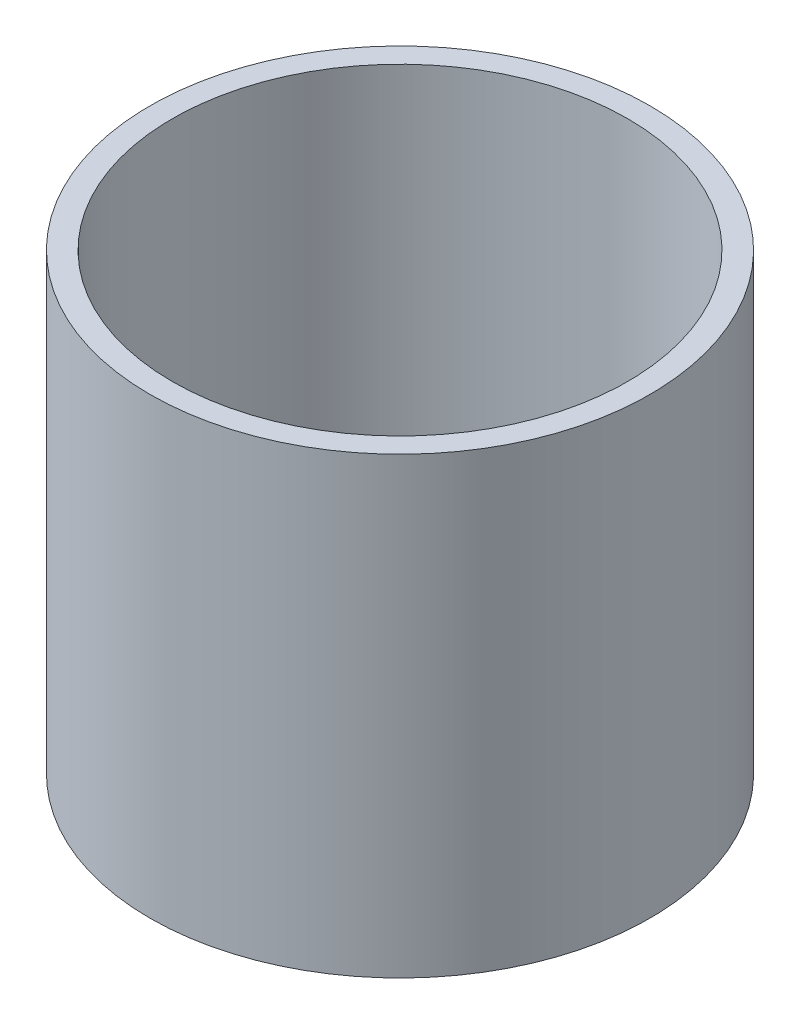
ISO-10303-21;
HEADER;
FILE_DESCRIPTION(('STEP AP214'),'2;1');
FILE_NAME('part.step','',(''),(''),'','','');
FILE_SCHEMA(('AUTOMOTIVE_DESIGN { 1 0 10303 214 1 1 1 1 }'));
ENDSEC;
DATA;
#1=APPLICATION_CONTEXT('core data for automotive mechanical design processes');
#2=APPLICATION_PROTOCOL_DEFINITION('international standard','automotive_design',2000,#1);
#3=PRODUCT_CONTEXT('',#1,'mechanical');
#4=PRODUCT('Part','Part','',(#3));
#5=PRODUCT_RELATED_PRODUCT_CATEGORY('part','',(#4));
#6=PRODUCT_DEFINITION_FORMATION('','',#4);
#7=PRODUCT_DEFINITION_CONTEXT('part definition',#1,'design');
#8=PRODUCT_DEFINITION('design','',#6,#7);
#9=PRODUCT_DEFINITION_SHAPE('','',#8);
#10=(LENGTH_UNIT() NAMED_UNIT(*) SI_UNIT(.MILLI.,.METRE.));
#11=(NAMED_UNIT(*) PLANE_ANGLE_UNIT() SI_UNIT($,.RADIAN.));
#12=(NAMED_UNIT(*) SI_UNIT($,.STERADIAN.) SOLID_ANGLE_UNIT());
#13=UNCERTAINTY_MEASURE_WITH_UNIT(LENGTH_MEASURE(1.E-05),#10,'distance_accuracy_value','');
#14=(GEOMETRIC_REPRESENTATION_CONTEXT(3) GLOBAL_UNCERTAINTY_ASSIGNED_CONTEXT((#13)) GLOBAL_UNIT_ASSIGNED_CONTEXT((#10,
#11,#12)) REPRESENTATION_CONTEXT('',''));
#15=CARTESIAN_POINT('',(0.,0.,0.));
#16=DIRECTION('',(0.,0.,1.));
#17=DIRECTION('',(1.,0.,0.));
#18=AXIS2_PLACEMENT_3D('',#15,#16,#17);
#19=CARTESIAN_POINT('',(25.5,0.,0.));
#20=DIRECTION('',(0.,1.,0.));
#21=DIRECTION('',(0.,0.,1.));
#22=AXIS2_PLACEMENT_3D('',#19,#20,#21);
#23=PLANE('',#22);
#24=CARTESIAN_POINT('',(0.,0.,0.));
#25=DIRECTION('',(0.,1.,0.));
#26=DIRECTION('',(0.,0.,1.));
#27=AXIS2_PLACEMENT_3D('',#24,#25,#26);
#28=CIRCLE('',#27,28.);
#29=CARTESIAN_POINT('',(0.,0.,28.));
#30=VERTEX_POINT('',#29);
#31=EDGE_CURVE('E10',#30,#30,#28,.T.);
#32=ORIENTED_EDGE('',*,*,#31,.F.);
#33=EDGE_LOOP('',(#32));
#34=FACE_BOUND('',#33,.T.);
#35=CARTESIAN_POINT('',(0.,0.,0.));
#36=DIRECTION('',(0.,1.,0.));
#37=DIRECTION('',(0.,0.,1.));
#38=AXIS2_PLACEMENT_3D('',#35,#36,#37);
#39=CIRCLE('',#38,25.5);
#40=CARTESIAN_POINT('',(0.,0.,25.5));
#41=VERTEX_POINT('',#40);
#42=EDGE_CURVE('E51',#41,#41,#39,.T.);
#43=ORIENTED_EDGE('',*,*,#42,.T.);
#44=EDGE_LOOP('',(#43));
#45=FACE_BOUND('',#44,.T.);
#46=ADVANCED_FACE('F37',(#34,#45),#23,.F.);
#47=CARTESIAN_POINT('',(0.,161.376166943427,0.));
#48=DIRECTION('',(0.,1.,0.));
#49=DIRECTION('',(0.,0.,1.));
#50=AXIS2_PLACEMENT_3D('',#47,#48,#49);
#51=CYLINDRICAL_SURFACE('',#50,28.);
#52=CARTESIAN_POINT('',(0.,50.8,0.));
#53=DIRECTION('',(0.,1.,0.));
#54=DIRECTION('',(0.,0.,1.));
#55=AXIS2_PLACEMENT_3D('',#52,#53,#54);
#56=CIRCLE('',#55,28.);
#57=CARTESIAN_POINT('',(0.,50.8,28.));
#58=VERTEX_POINT('',#57);
#59=EDGE_CURVE('E43',#58,#58,#56,.T.);
#60=ORIENTED_EDGE('',*,*,#59,.F.);
#61=EDGE_LOOP('',(#60));
#62=FACE_BOUND('',#61,.T.);
#63=ORIENTED_EDGE('',*,*,#31,.T.);
#64=EDGE_LOOP('',(#63));
#65=FACE_BOUND('',#64,.T.);
#66=ADVANCED_FACE('F66',(#62,#65),#51,.T.);
#67=CARTESIAN_POINT('',(25.5,50.8,0.));
#68=DIRECTION('',(0.,-1.,0.));
#69=DIRECTION('',(0.,0.,-1.));
#70=AXIS2_PLACEMENT_3D('',#67,#68,#69);
#71=PLANE('',#70);
#72=CARTESIAN_POINT('',(0.,50.8,0.));
#73=DIRECTION('',(0.,1.,0.));
#74=DIRECTION('',(0.,0.,1.));
#75=AXIS2_PLACEMENT_3D('',#72,#73,#74);
#76=CIRCLE('',#75,25.5);
#77=CARTESIAN_POINT('',(0.,50.8,25.5));
#78=VERTEX_POINT('',#77);
#79=EDGE_CURVE('E47',#78,#78,#76,.T.);
#80=ORIENTED_EDGE('',*,*,#79,.F.);
#81=EDGE_LOOP('',(#80));
#82=FACE_BOUND('',#81,.T.);
#83=ORIENTED_EDGE('',*,*,#59,.T.);
#84=EDGE_LOOP('',(#83));
#85=FACE_BOUND('',#84,.T.);
#86=ADVANCED_FACE('F61',(#82,#85),#71,.F.);
#87=CARTESIAN_POINT('',(0.,161.376166943427,0.));
#88=DIRECTION('',(0.,1.,0.));
#89=DIRECTION('',(0.,0.,1.));
#90=AXIS2_PLACEMENT_3D('',#87,#88,#89);
#91=CYLINDRICAL_SURFACE('',#90,25.5);
#92=ORIENTED_EDGE('',*,*,#42,.F.);
#93=EDGE_LOOP('',(#92));
#94=FACE_BOUND('',#93,.T.);
#95=ORIENTED_EDGE('',*,*,#79,.T.);
#96=EDGE_LOOP('',(#95));
#97=FACE_BOUND('',#96,.T.);
#98=ADVANCED_FACE('F58',(#94,#97),#91,.F.);
#99=CLOSED_SHELL('',(#46,#66,#86,#98));
#100=MANIFOLD_SOLID_BREP('B2',#99);
#101=ADVANCED_BREP_SHAPE_REPRESENTATION('',(#18,#100),#14);
#102=SHAPE_DEFINITION_REPRESENTATION(#9,#101);
ENDSEC;
END-ISO-10303-21;
